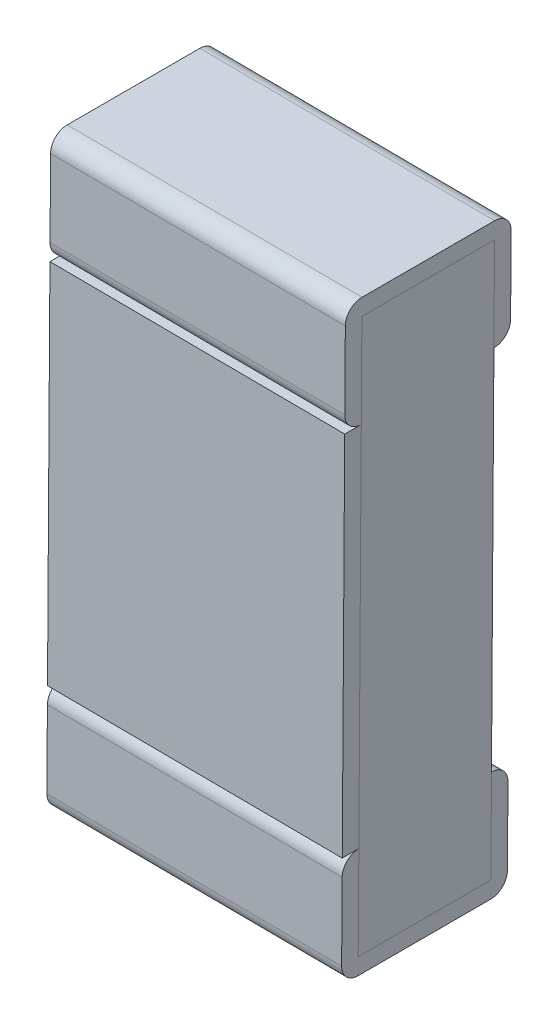
ISO-10303-21;
HEADER;
FILE_DESCRIPTION(('STEP AP214'),'2;1');
FILE_NAME('part.step','',(''),(''),'','','');
FILE_SCHEMA(('AUTOMOTIVE_DESIGN { 1 0 10303 214 1 1 1 1 }'));
ENDSEC;
DATA;
#1=APPLICATION_CONTEXT('core data for automotive mechanical design processes');
#2=APPLICATION_PROTOCOL_DEFINITION('international standard','automotive_design',2000,#1);
#3=PRODUCT_CONTEXT('',#1,'mechanical');
#4=PRODUCT('Part','Part','',(#3));
#5=PRODUCT_RELATED_PRODUCT_CATEGORY('part','',(#4));
#6=PRODUCT_DEFINITION_FORMATION('','',#4);
#7=PRODUCT_DEFINITION_CONTEXT('part definition',#1,'design');
#8=PRODUCT_DEFINITION('design','',#6,#7);
#9=PRODUCT_DEFINITION_SHAPE('','',#8);
#10=(LENGTH_UNIT() NAMED_UNIT(*) SI_UNIT(.MILLI.,.METRE.));
#11=(NAMED_UNIT(*) PLANE_ANGLE_UNIT() SI_UNIT($,.RADIAN.));
#12=(NAMED_UNIT(*) SI_UNIT($,.STERADIAN.) SOLID_ANGLE_UNIT());
#13=UNCERTAINTY_MEASURE_WITH_UNIT(LENGTH_MEASURE(1.E-05),#10,'distance_accuracy_value','');
#14=(GEOMETRIC_REPRESENTATION_CONTEXT(3) GLOBAL_UNCERTAINTY_ASSIGNED_CONTEXT((#13)) GLOBAL_UNIT_ASSIGNED_CONTEXT((#10,
#11,#12)) REPRESENTATION_CONTEXT('',''));
#15=CARTESIAN_POINT('',(0.,0.,0.));
#16=DIRECTION('',(0.,0.,1.));
#17=DIRECTION('',(1.,0.,0.));
#18=AXIS2_PLACEMENT_3D('',#15,#16,#17);
#19=CARTESIAN_POINT('',(189.293084408951,106.579494222817,142.661582908599));
#20=DIRECTION('',(0.,0.,1.));
#21=DIRECTION('',(1.,0.,0.));
#22=AXIS2_PLACEMENT_3D('',#19,#20,#21);
#23=PLANE('',#22);
#24=DIRECTION('',(0.999978016708569,-0.00663069374923689,0.));
#25=VECTOR('',#24,1.);
#26=CARTESIAN_POINT('',(189.293084408951,106.579494222817,142.661582908599));
#27=LINE('',#26,#25);
#28=CARTESIAN_POINT('',(189.293084408951,106.579494222817,142.661582908599));
#29=VERTEX_POINT('',#28);
#30=CARTESIAN_POINT('',(190.093066822317,106.574189667818,142.661582908599));
#31=VERTEX_POINT('',#30);
#32=EDGE_CURVE('E67',#29,#31,#27,.T.);
#33=ORIENTED_EDGE('',*,*,#32,.F.);
#34=DIRECTION('',(-0.00663069374923689,-0.999978016708569,0.));
#35=VECTOR('',#34,1.);
#36=CARTESIAN_POINT('',(189.293084408951,106.579494222817,142.661582908599));
#37=LINE('',#36,#35);
#38=CARTESIAN_POINT('',(189.286453715202,105.579516206109,142.661582908599));
#39=VERTEX_POINT('',#38);
#40=EDGE_CURVE('E11',#29,#39,#37,.T.);
#41=ORIENTED_EDGE('',*,*,#40,.T.);
#42=DIRECTION('',(0.999978016708569,-0.00663069374923689,0.));
#43=VECTOR('',#42,1.);
#44=CARTESIAN_POINT('',(189.286453715202,105.579516206109,142.661582908599));
#45=LINE('',#44,#43);
#46=CARTESIAN_POINT('',(190.086436128569,105.574211651109,142.661582908599));
#47=VERTEX_POINT('',#46);
#48=EDGE_CURVE('E55',#39,#47,#45,.T.);
#49=ORIENTED_EDGE('',*,*,#48,.T.);
#50=DIRECTION('',(-0.00663069374923689,-0.999978016708569,0.));
#51=VECTOR('',#50,1.);
#52=CARTESIAN_POINT('',(190.093066822317,106.574189667818,142.661582908599));
#53=LINE('',#52,#51);
#54=EDGE_CURVE('E268',#31,#47,#53,.T.);
#55=ORIENTED_EDGE('',*,*,#54,.F.);
#56=EDGE_LOOP('',(#33,#41,#49,#55));
#57=FACE_BOUND('',#56,.T.);
#58=ADVANCED_FACE('F44',(#57),#23,.T.);
#59=CARTESIAN_POINT('',(189.286453715202,105.579516206109,142.616582908599));
#60=DIRECTION('',(-0.00663069374923689,-0.99997801670857,0.));
#61=DIRECTION('',(-0.99997801670857,0.00663069374923689,0.));
#62=AXIS2_PLACEMENT_3D('',#59,#60,#61);
#63=PLANE('',#62);
#64=DIRECTION('',(0.,0.,1.));
#65=VECTOR('',#64,1.);
#66=CARTESIAN_POINT('',(189.286453715202,105.579516206109,142.616582908599));
#67=LINE('',#66,#65);
#68=CARTESIAN_POINT('',(189.286453715202,105.579516206109,142.616582908599));
#69=VERTEX_POINT('',#68);
#70=EDGE_CURVE('E288',#69,#39,#67,.T.);
#71=ORIENTED_EDGE('',*,*,#70,.F.);
#72=DIRECTION('',(0.999978016708569,-0.00663069374923689,0.));
#73=VECTOR('',#72,1.);
#74=CARTESIAN_POINT('',(189.286453715202,105.579516206109,142.616582908599));
#75=LINE('',#74,#73);
#76=CARTESIAN_POINT('',(190.086436128569,105.574211651109,142.616582908599));
#77=VERTEX_POINT('',#76);
#78=EDGE_CURVE('E189',#69,#77,#75,.T.);
#79=ORIENTED_EDGE('',*,*,#78,.T.);
#80=DIRECTION('',(0.,0.,1.));
#81=VECTOR('',#80,1.);
#82=CARTESIAN_POINT('',(190.086436128569,105.574211651109,142.616582908599));
#83=LINE('',#82,#81);
#84=EDGE_CURVE('E193',#77,#47,#83,.T.);
#85=ORIENTED_EDGE('',*,*,#84,.T.);
#86=ORIENTED_EDGE('',*,*,#48,.F.);
#87=EDGE_LOOP('',(#71,#79,#85,#86));
#88=FACE_BOUND('',#87,.T.);
#89=ADVANCED_FACE('F552',(#88),#63,.T.);
#90=CARTESIAN_POINT('',(189.286155333983,105.534517195357,142.616582908599));
#91=DIRECTION('',(0.999978016708571,-0.00663069374900344,0.));
#92=DIRECTION('',(0.00663069374900344,0.999978016708571,0.));
#93=AXIS2_PLACEMENT_3D('',#90,#91,#92);
#94=CYLINDRICAL_SURFACE('',#93,0.0450000000000037);
#95=CARTESIAN_POINT('',(189.286155333983,105.534517195357,142.616582908599));
#96=DIRECTION('',(0.99997801670857,-0.00663069374923689,0.));
#97=DIRECTION('',(0.,0.,1.));
#98=AXIS2_PLACEMENT_3D('',#95,#96,#97);
#99=CIRCLE('',#98,0.0449999999999895);
#100=CARTESIAN_POINT('',(189.286155333983,105.534517195357,142.661582908599));
#101=VERTEX_POINT('',#100);
#102=EDGE_CURVE('E341',#69,#101,#99,.T.);
#103=ORIENTED_EDGE('',*,*,#102,.T.);
#104=DIRECTION('',(0.999978016708569,-0.00663069374923689,0.));
#105=VECTOR('',#104,1.);
#106=CARTESIAN_POINT('',(189.286155333983,105.534517195357,142.661582908599));
#107=LINE('',#106,#105);
#108=CARTESIAN_POINT('',(190.08613774735,105.529212640357,142.661582908599));
#109=VERTEX_POINT('',#108);
#110=EDGE_CURVE('E182',#101,#109,#107,.T.);
#111=ORIENTED_EDGE('',*,*,#110,.T.);
#112=CARTESIAN_POINT('',(190.08613774735,105.529212640357,142.616582908599));
#113=DIRECTION('',(0.99997801670857,-0.00663069374923689,0.));
#114=DIRECTION('',(0.,0.,1.));
#115=AXIS2_PLACEMENT_3D('',#112,#113,#114);
#116=CIRCLE('',#115,0.0449999999999895);
#117=EDGE_CURVE('E374',#77,#109,#116,.T.);
#118=ORIENTED_EDGE('',*,*,#117,.F.);
#119=ORIENTED_EDGE('',*,*,#78,.F.);
#120=EDGE_LOOP('',(#103,#111,#118,#119));
#121=FACE_BOUND('',#120,.T.);
#122=ADVANCED_FACE('F46',(#121),#94,.T.);
#123=CARTESIAN_POINT('',(189.286453715202,105.579516206109,142.661582908599));
#124=DIRECTION('',(0.,0.,1.));
#125=DIRECTION('',(1.,0.,0.));
#126=AXIS2_PLACEMENT_3D('',#123,#124,#125);
#127=PLANE('',#126);
#128=DIRECTION('',(-0.00663069374923689,-0.999978016708569,0.));
#129=VECTOR('',#128,1.);
#130=CARTESIAN_POINT('',(190.086436128569,105.574211651109,142.661582908599));
#131=LINE('',#130,#129);
#132=CARTESIAN_POINT('',(190.084745301663,105.319217256848,142.661582908599));
#133=VERTEX_POINT('',#132);
#134=EDGE_CURVE('E224',#109,#133,#131,.T.);
#135=ORIENTED_EDGE('',*,*,#134,.F.);
#136=ORIENTED_EDGE('',*,*,#110,.F.);
#137=DIRECTION('',(-0.00663069374923689,-0.999978016708569,0.));
#138=VECTOR('',#137,1.);
#139=CARTESIAN_POINT('',(189.286453715202,105.579516206109,142.661582908599));
#140=LINE('',#139,#138);
#141=CARTESIAN_POINT('',(189.284762888296,105.324521811848,142.661582908599));
#142=VERTEX_POINT('',#141);
#143=EDGE_CURVE('E350',#101,#142,#140,.T.);
#144=ORIENTED_EDGE('',*,*,#143,.T.);
#145=DIRECTION('',(0.999978016708569,-0.00663069374923689,0.));
#146=VECTOR('',#145,1.);
#147=CARTESIAN_POINT('',(189.284762888296,105.324521811848,142.661582908599));
#148=LINE('',#147,#146);
#149=EDGE_CURVE('E326',#142,#133,#148,.T.);
#150=ORIENTED_EDGE('',*,*,#149,.T.);
#151=EDGE_LOOP('',(#135,#136,#144,#150));
#152=FACE_BOUND('',#151,.T.);
#153=ADVANCED_FACE('F400',(#152),#127,.T.);
#154=CARTESIAN_POINT('',(189.284762888296,105.324521811848,142.616582908599));
#155=DIRECTION('',(0.999978016708571,-0.00663069374900344,0.));
#156=DIRECTION('',(-0.00663069374900344,-0.999978016708571,0.));
#157=AXIS2_PLACEMENT_3D('',#154,#155,#156);
#158=CYLINDRICAL_SURFACE('',#157,0.0450000000000037);
#159=DIRECTION('',(0.999978016708569,-0.00663069374923689,0.));
#160=VECTOR('',#159,1.);
#161=CARTESIAN_POINT('',(189.284464507077,105.279522801096,142.616582908599));
#162=LINE('',#161,#160);
#163=CARTESIAN_POINT('',(189.284464507077,105.279522801096,142.616582908599));
#164=VERTEX_POINT('',#163);
#165=CARTESIAN_POINT('',(190.084446920444,105.274218246097,142.616582908599));
#166=VERTEX_POINT('',#165);
#167=EDGE_CURVE('E263',#164,#166,#162,.T.);
#168=ORIENTED_EDGE('',*,*,#167,.T.);
#169=CARTESIAN_POINT('',(190.084745301663,105.319217256848,142.616582908599));
#170=DIRECTION('',(-0.99997801670857,0.00663069374923689,0.));
#171=DIRECTION('',(0.,0.,1.));
#172=AXIS2_PLACEMENT_3D('',#169,#170,#171);
#173=CIRCLE('',#172,0.0449999999999895);
#174=EDGE_CURVE('E254',#166,#133,#173,.T.);
#175=ORIENTED_EDGE('',*,*,#174,.T.);
#176=ORIENTED_EDGE('',*,*,#149,.F.);
#177=CARTESIAN_POINT('',(189.284762888296,105.324521811848,142.616582908599));
#178=DIRECTION('',(-0.99997801670857,0.00663069374923689,0.));
#179=DIRECTION('',(0.,0.,1.));
#180=AXIS2_PLACEMENT_3D('',#177,#178,#179);
#181=CIRCLE('',#180,0.0449999999999895);
#182=EDGE_CURVE('E199',#164,#142,#181,.T.);
#183=ORIENTED_EDGE('',*,*,#182,.F.);
#184=EDGE_LOOP('',(#168,#175,#176,#183));
#185=FACE_BOUND('',#184,.T.);
#186=ADVANCED_FACE('F409',(#185),#158,.T.);
#187=CARTESIAN_POINT('',(189.284464507077,105.279522801096,142.211582908599));
#188=DIRECTION('',(-0.00663069374923689,-0.99997801670857,0.));
#189=DIRECTION('',(-0.99997801670857,0.00663069374923689,0.));
#190=AXIS2_PLACEMENT_3D('',#187,#188,#189);
#191=PLANE('',#190);
#192=DIRECTION('',(0.,0.,1.));
#193=VECTOR('',#192,1.);
#194=CARTESIAN_POINT('',(189.284464507077,105.279522801096,142.211582908599));
#195=LINE('',#194,#193);
#196=CARTESIAN_POINT('',(189.284464507077,105.279522801096,142.256582908599));
#197=VERTEX_POINT('',#196);
#198=EDGE_CURVE('E194',#197,#164,#195,.T.);
#199=ORIENTED_EDGE('',*,*,#198,.F.);
#200=DIRECTION('',(0.999978016708569,-0.00663069374923689,0.));
#201=VECTOR('',#200,1.);
#202=CARTESIAN_POINT('',(189.284464507077,105.279522801096,142.256582908599));
#203=LINE('',#202,#201);
#204=CARTESIAN_POINT('',(190.084446920444,105.274218246097,142.256582908599));
#205=VERTEX_POINT('',#204);
#206=EDGE_CURVE('E187',#197,#205,#203,.T.);
#207=ORIENTED_EDGE('',*,*,#206,.T.);
#208=DIRECTION('',(0.,0.,1.));
#209=VECTOR('',#208,1.);
#210=CARTESIAN_POINT('',(190.084446920444,105.274218246097,142.211582908599));
#211=LINE('',#210,#209);
#212=EDGE_CURVE('E184',#205,#166,#211,.T.);
#213=ORIENTED_EDGE('',*,*,#212,.T.);
#214=ORIENTED_EDGE('',*,*,#167,.F.);
#215=EDGE_LOOP('',(#199,#207,#213,#214));
#216=FACE_BOUND('',#215,.T.);
#217=ADVANCED_FACE('F654',(#216),#191,.T.);
#218=CARTESIAN_POINT('',(189.284762888296,105.324521811848,142.256582908599));
#219=DIRECTION('',(0.999978016708571,-0.00663069374900344,0.));
#220=DIRECTION('',(-0.00663069374900344,-0.999978016708571,0.));
#221=AXIS2_PLACEMENT_3D('',#218,#219,#220);
#222=CYLINDRICAL_SURFACE('',#221,0.0450000000000037);
#223=CARTESIAN_POINT('',(189.284762888296,105.324521811848,142.256582908599));
#224=DIRECTION('',(0.99997801670857,-0.00663069374923689,0.));
#225=DIRECTION('',(0.,0.,1.));
#226=AXIS2_PLACEMENT_3D('',#223,#224,#225);
#227=CIRCLE('',#226,0.0449999999999895);
#228=CARTESIAN_POINT('',(189.284762888296,105.324521811848,142.211582908599));
#229=VERTEX_POINT('',#228);
#230=EDGE_CURVE('E188',#197,#229,#227,.T.);
#231=ORIENTED_EDGE('',*,*,#230,.T.);
#232=DIRECTION('',(0.999978016708569,-0.00663069374923689,0.));
#233=VECTOR('',#232,1.);
#234=CARTESIAN_POINT('',(189.284762888296,105.324521811848,142.211582908599));
#235=LINE('',#234,#233);
#236=CARTESIAN_POINT('',(190.084745301663,105.319217256848,142.211582908599));
#237=VERTEX_POINT('',#236);
#238=EDGE_CURVE('E303',#229,#237,#235,.T.);
#239=ORIENTED_EDGE('',*,*,#238,.T.);
#240=CARTESIAN_POINT('',(190.084745301663,105.319217256848,142.256582908599));
#241=DIRECTION('',(0.99997801670857,-0.00663069374923689,0.));
#242=DIRECTION('',(0.,0.,1.));
#243=AXIS2_PLACEMENT_3D('',#240,#241,#242);
#244=CIRCLE('',#243,0.0449999999999895);
#245=EDGE_CURVE('E220',#205,#237,#244,.T.);
#246=ORIENTED_EDGE('',*,*,#245,.F.);
#247=ORIENTED_EDGE('',*,*,#206,.F.);
#248=EDGE_LOOP('',(#231,#239,#246,#247));
#249=FACE_BOUND('',#248,.T.);
#250=ADVANCED_FACE('F650',(#249),#222,.T.);
#251=CARTESIAN_POINT('',(189.286453715202,105.579516206109,142.211582908599));
#252=DIRECTION('',(0.,0.,1.));
#253=DIRECTION('',(1.,0.,0.));
#254=AXIS2_PLACEMENT_3D('',#251,#252,#253);
#255=PLANE('',#254);
#256=ORIENTED_EDGE('',*,*,#238,.F.);
#257=DIRECTION('',(-0.00663069374923689,-0.999978016708569,0.));
#258=VECTOR('',#257,1.);
#259=CARTESIAN_POINT('',(189.286453715202,105.579516206109,142.211582908599));
#260=LINE('',#259,#258);
#261=CARTESIAN_POINT('',(189.286155333983,105.534517195357,142.211582908599));
#262=VERTEX_POINT('',#261);
#263=EDGE_CURVE('E205',#262,#229,#260,.T.);
#264=ORIENTED_EDGE('',*,*,#263,.F.);
#265=DIRECTION('',(0.999978016708569,-0.00663069374923689,0.));
#266=VECTOR('',#265,1.);
#267=CARTESIAN_POINT('',(189.286155333983,105.534517195357,142.211582908599));
#268=LINE('',#267,#266);
#269=CARTESIAN_POINT('',(190.08613774735,105.529212640357,142.211582908599));
#270=VERTEX_POINT('',#269);
#271=EDGE_CURVE('E307',#262,#270,#268,.T.);
#272=ORIENTED_EDGE('',*,*,#271,.T.);
#273=DIRECTION('',(-0.00663069374923689,-0.999978016708569,0.));
#274=VECTOR('',#273,1.);
#275=CARTESIAN_POINT('',(190.086436128569,105.574211651109,142.211582908599));
#276=LINE('',#275,#274);
#277=EDGE_CURVE('E308',#270,#237,#276,.T.);
#278=ORIENTED_EDGE('',*,*,#277,.T.);
#279=EDGE_LOOP('',(#256,#264,#272,#278));
#280=FACE_BOUND('',#279,.T.);
#281=ADVANCED_FACE('F632',(#280),#255,.F.);
#282=CARTESIAN_POINT('',(189.286155333983,105.534517195357,142.256582908599));
#283=DIRECTION('',(0.999978016708571,-0.00663069374900344,0.));
#284=DIRECTION('',(0.00663069374900344,0.999978016708571,0.));
#285=AXIS2_PLACEMENT_3D('',#282,#283,#284);
#286=CYLINDRICAL_SURFACE('',#285,0.0450000000000037);
#287=DIRECTION('',(0.999978016708569,-0.00663069374923689,0.));
#288=VECTOR('',#287,1.);
#289=CARTESIAN_POINT('',(189.286453715202,105.579516206109,142.256582908599));
#290=LINE('',#289,#288);
#291=CARTESIAN_POINT('',(189.286453715202,105.579516206109,142.256582908599));
#292=VERTEX_POINT('',#291);
#293=CARTESIAN_POINT('',(190.086436128569,105.574211651109,142.256582908599));
#294=VERTEX_POINT('',#293);
#295=EDGE_CURVE('E237',#292,#294,#290,.T.);
#296=ORIENTED_EDGE('',*,*,#295,.T.);
#297=CARTESIAN_POINT('',(190.08613774735,105.529212640357,142.256582908599));
#298=DIRECTION('',(-0.99997801670857,0.00663069374923689,0.));
#299=DIRECTION('',(0.,0.,1.));
#300=AXIS2_PLACEMENT_3D('',#297,#298,#299);
#301=CIRCLE('',#300,0.0449999999999895);
#302=EDGE_CURVE('E233',#294,#270,#301,.T.);
#303=ORIENTED_EDGE('',*,*,#302,.T.);
#304=ORIENTED_EDGE('',*,*,#271,.F.);
#305=CARTESIAN_POINT('',(189.286155333983,105.534517195357,142.256582908599));
#306=DIRECTION('',(-0.99997801670857,0.00663069374923689,0.));
#307=DIRECTION('',(0.,0.,1.));
#308=AXIS2_PLACEMENT_3D('',#305,#306,#307);
#309=CIRCLE('',#308,0.0449999999999895);
#310=EDGE_CURVE('E200',#292,#262,#309,.T.);
#311=ORIENTED_EDGE('',*,*,#310,.F.);
#312=EDGE_LOOP('',(#296,#303,#304,#311));
#313=FACE_BOUND('',#312,.T.);
#314=ADVANCED_FACE('F513',(#313),#286,.T.);
#315=CARTESIAN_POINT('',(190.093066822317,106.574189667818,142.616582908599));
#316=DIRECTION('',(0.99997801670857,-0.00663069374923689,0.));
#317=DIRECTION('',(0.,0.,-1.));
#318=AXIS2_PLACEMENT_3D('',#315,#316,#317);
#319=PLANE('',#318);
#320=DIRECTION('',(-0.00663069374923689,-0.999978016708569,0.));
#321=VECTOR('',#320,1.);
#322=CARTESIAN_POINT('',(190.093066822317,106.574189667818,142.616582908599));
#323=LINE('',#322,#321);
#324=CARTESIAN_POINT('',(190.093066822317,106.574189667818,142.616582908599));
#325=VERTEX_POINT('',#324);
#326=EDGE_CURVE('E339',#325,#77,#323,.T.);
#327=ORIENTED_EDGE('',*,*,#326,.F.);
#328=DIRECTION('',(0.,0.,1.));
#329=VECTOR('',#328,1.);
#330=CARTESIAN_POINT('',(190.093066822317,106.574189667818,142.616582908599));
#331=LINE('',#330,#329);
#332=EDGE_CURVE('E238',#325,#31,#331,.T.);
#333=ORIENTED_EDGE('',*,*,#332,.T.);
#334=ORIENTED_EDGE('',*,*,#54,.T.);
#335=ORIENTED_EDGE('',*,*,#84,.F.);
#336=EDGE_LOOP('',(#327,#333,#334,#335));
#337=FACE_BOUND('',#336,.T.);
#338=ADVANCED_FACE('F631',(#337),#319,.T.);
#339=CARTESIAN_POINT('',(190.086436128569,105.574211651109,142.211582908599));
#340=DIRECTION('',(0.99997801670857,-0.00663069374923689,0.));
#341=DIRECTION('',(0.,0.,-1.));
#342=AXIS2_PLACEMENT_3D('',#339,#340,#341);
#343=PLANE('',#342);
#344=ORIENTED_EDGE('',*,*,#277,.F.);
#345=ORIENTED_EDGE('',*,*,#302,.F.);
#346=DIRECTION('',(-0.00663069374923689,-0.999978016708569,0.));
#347=VECTOR('',#346,1.);
#348=CARTESIAN_POINT('',(190.094757649223,106.829184062078,142.256582908599));
#349=LINE('',#348,#347);
#350=CARTESIAN_POINT('',(190.084745301663,105.319217256848,142.256582908599));
#351=VERTEX_POINT('',#350);
#352=EDGE_CURVE('E264',#294,#351,#349,.T.);
#353=ORIENTED_EDGE('',*,*,#352,.T.);
#354=DIRECTION('',(0.,0.,1.));
#355=VECTOR('',#354,1.);
#356=CARTESIAN_POINT('',(190.084745301663,105.319217256848,142.256582908599));
#357=LINE('',#356,#355);
#358=CARTESIAN_POINT('',(190.084745301663,105.319217256848,142.616582908599));
#359=VERTEX_POINT('',#358);
#360=EDGE_CURVE('E269',#351,#359,#357,.T.);
#361=ORIENTED_EDGE('',*,*,#360,.T.);
#362=DIRECTION('',(-0.00663069374923689,-0.999978016708569,0.));
#363=VECTOR('',#362,1.);
#364=CARTESIAN_POINT('',(190.094757649223,106.829184062078,142.616582908599));
#365=LINE('',#364,#363);
#366=EDGE_CURVE('E356',#77,#359,#365,.T.);
#367=ORIENTED_EDGE('',*,*,#366,.F.);
#368=ORIENTED_EDGE('',*,*,#117,.T.);
#369=ORIENTED_EDGE('',*,*,#134,.T.);
#370=ORIENTED_EDGE('',*,*,#174,.F.);
#371=ORIENTED_EDGE('',*,*,#212,.F.);
#372=ORIENTED_EDGE('',*,*,#245,.T.);
#373=EDGE_LOOP('',(#344,#345,#353,#361,#367,#368,#369,#370,#371,#372));
#374=FACE_BOUND('',#373,.T.);
#375=ADVANCED_FACE('F412',(#374),#343,.T.);
#376=CARTESIAN_POINT('',(189.293084408951,106.579494222817,142.616582908599));
#377=DIRECTION('',(-0.00663069374923689,-0.99997801670857,0.));
#378=DIRECTION('',(-0.99997801670857,0.00663069374923689,0.));
#379=AXIS2_PLACEMENT_3D('',#376,#377,#378);
#380=PLANE('',#379);
#381=ORIENTED_EDGE('',*,*,#32,.T.);
#382=ORIENTED_EDGE('',*,*,#332,.F.);
#383=DIRECTION('',(0.999978016708569,-0.00663069374923689,0.));
#384=VECTOR('',#383,1.);
#385=CARTESIAN_POINT('',(189.293084408951,106.579494222817,142.616582908599));
#386=LINE('',#385,#384);
#387=CARTESIAN_POINT('',(189.293084408951,106.579494222817,142.616582908599));
#388=VERTEX_POINT('',#387);
#389=EDGE_CURVE('E178',#388,#325,#386,.T.);
#390=ORIENTED_EDGE('',*,*,#389,.F.);
#391=DIRECTION('',(0.,0.,1.));
#392=VECTOR('',#391,1.);
#393=CARTESIAN_POINT('',(189.293084408951,106.579494222817,142.616582908599));
#394=LINE('',#393,#392);
#395=EDGE_CURVE('E278',#388,#29,#394,.T.);
#396=ORIENTED_EDGE('',*,*,#395,.T.);
#397=EDGE_LOOP('',(#381,#382,#390,#396));
#398=FACE_BOUND('',#397,.T.);
#399=ADVANCED_FACE('F592',(#398),#380,.F.);
#400=CARTESIAN_POINT('',(189.293084408951,106.579494222817,142.616582908599));
#401=DIRECTION('',(0.99997801670857,-0.00663069374923689,0.));
#402=DIRECTION('',(0.,0.,-1.));
#403=AXIS2_PLACEMENT_3D('',#400,#401,#402);
#404=PLANE('',#403);
#405=ORIENTED_EDGE('',*,*,#70,.T.);
#406=ORIENTED_EDGE('',*,*,#40,.F.);
#407=ORIENTED_EDGE('',*,*,#395,.F.);
#408=DIRECTION('',(-0.00663069374923689,-0.999978016708569,0.));
#409=VECTOR('',#408,1.);
#410=CARTESIAN_POINT('',(189.293084408951,106.579494222817,142.616582908599));
#411=LINE('',#410,#409);
#412=EDGE_CURVE('E198',#388,#69,#411,.T.);
#413=ORIENTED_EDGE('',*,*,#412,.T.);
#414=EDGE_LOOP('',(#405,#406,#407,#413));
#415=FACE_BOUND('',#414,.T.);
#416=ADVANCED_FACE('F596',(#415),#404,.F.);
#417=CARTESIAN_POINT('',(189.286453715202,105.579516206109,142.211582908599));
#418=DIRECTION('',(0.99997801670857,-0.00663069374923689,0.));
#419=DIRECTION('',(0.,0.,-1.));
#420=AXIS2_PLACEMENT_3D('',#417,#418,#419);
#421=PLANE('',#420);
#422=ORIENTED_EDGE('',*,*,#230,.F.);
#423=ORIENTED_EDGE('',*,*,#198,.T.);
#424=ORIENTED_EDGE('',*,*,#182,.T.);
#425=ORIENTED_EDGE('',*,*,#143,.F.);
#426=ORIENTED_EDGE('',*,*,#102,.F.);
#427=DIRECTION('',(-0.00663069374923689,-0.999978016708569,0.));
#428=VECTOR('',#427,1.);
#429=CARTESIAN_POINT('',(189.294775235857,106.834488617078,142.616582908599));
#430=LINE('',#429,#428);
#431=CARTESIAN_POINT('',(189.284762888296,105.324521811848,142.616582908599));
#432=VERTEX_POINT('',#431);
#433=EDGE_CURVE('E204',#69,#432,#430,.T.);
#434=ORIENTED_EDGE('',*,*,#433,.T.);
#435=DIRECTION('',(0.,0.,1.));
#436=VECTOR('',#435,1.);
#437=CARTESIAN_POINT('',(189.284762888296,105.324521811848,142.256582908599));
#438=LINE('',#437,#436);
#439=CARTESIAN_POINT('',(189.284762888296,105.324521811848,142.256582908599));
#440=VERTEX_POINT('',#439);
#441=EDGE_CURVE('E249',#440,#432,#438,.T.);
#442=ORIENTED_EDGE('',*,*,#441,.F.);
#443=DIRECTION('',(-0.00663069374923689,-0.999978016708569,0.));
#444=VECTOR('',#443,1.);
#445=CARTESIAN_POINT('',(189.294775235857,106.834488617078,142.256582908599));
#446=LINE('',#445,#444);
#447=EDGE_CURVE('E246',#292,#440,#446,.T.);
#448=ORIENTED_EDGE('',*,*,#447,.F.);
#449=ORIENTED_EDGE('',*,*,#310,.T.);
#450=ORIENTED_EDGE('',*,*,#263,.T.);
#451=EDGE_LOOP('',(#422,#423,#424,#425,#426,#434,#442,#448,#449,#450));
#452=FACE_BOUND('',#451,.T.);
#453=ADVANCED_FACE('F503',(#452),#421,.F.);
#454=CARTESIAN_POINT('',(189.294775235857,106.834488617078,142.256582908599));
#455=DIRECTION('',(0.,0.,1.));
#456=DIRECTION('',(1.,0.,0.));
#457=AXIS2_PLACEMENT_3D('',#454,#455,#456);
#458=PLANE('',#457);
#459=DIRECTION('',(-0.00663069374923689,-0.999978016708569,0.));
#460=VECTOR('',#459,1.);
#461=CARTESIAN_POINT('',(190.094757649223,106.829184062078,142.256582908599));
#462=LINE('',#461,#460);
#463=CARTESIAN_POINT('',(190.093066822317,106.574189667818,142.256582908599));
#464=VERTEX_POINT('',#463);
#465=EDGE_CURVE('E273',#464,#294,#462,.T.);
#466=ORIENTED_EDGE('',*,*,#465,.T.);
#467=ORIENTED_EDGE('',*,*,#295,.F.);
#468=DIRECTION('',(-0.00663069374923689,-0.999978016708569,0.));
#469=VECTOR('',#468,1.);
#470=CARTESIAN_POINT('',(189.294775235857,106.834488617078,142.256582908599));
#471=LINE('',#470,#469);
#472=CARTESIAN_POINT('',(189.293084408951,106.579494222817,142.256582908599));
#473=VERTEX_POINT('',#472);
#474=EDGE_CURVE('E167',#473,#292,#471,.T.);
#475=ORIENTED_EDGE('',*,*,#474,.F.);
#476=DIRECTION('',(0.999978016708569,-0.00663069374923689,0.));
#477=VECTOR('',#476,1.);
#478=CARTESIAN_POINT('',(189.293084408951,106.579494222817,142.256582908599));
#479=LINE('',#478,#477);
#480=EDGE_CURVE('E270',#473,#464,#479,.T.);
#481=ORIENTED_EDGE('',*,*,#480,.T.);
#482=EDGE_LOOP('',(#466,#467,#475,#481));
#483=FACE_BOUND('',#482,.T.);
#484=ADVANCED_FACE('F515',(#483),#458,.F.);
#485=CARTESIAN_POINT('',(190.094757649223,106.829184062078,142.256582908599));
#486=DIRECTION('',(0.99997801670857,-0.00663069374923689,0.));
#487=DIRECTION('',(0.,0.,-1.));
#488=AXIS2_PLACEMENT_3D('',#485,#486,#487);
#489=PLANE('',#488);
#490=DIRECTION('',(-0.00663069374923689,-0.999978016708569,0.));
#491=VECTOR('',#490,1.);
#492=CARTESIAN_POINT('',(190.094757649223,106.829184062078,142.256582908599));
#493=LINE('',#492,#491);
#494=CARTESIAN_POINT('',(190.094757649223,106.829184062078,142.256582908599));
#495=VERTEX_POINT('',#494);
#496=EDGE_CURVE('E211',#495,#464,#493,.T.);
#497=ORIENTED_EDGE('',*,*,#496,.F.);
#498=DIRECTION('',(0.,0.,1.));
#499=VECTOR('',#498,1.);
#500=CARTESIAN_POINT('',(190.094757649223,106.829184062078,142.256582908599));
#501=LINE('',#500,#499);
#502=CARTESIAN_POINT('',(190.094757649223,106.829184062078,142.616582908599));
#503=VERTEX_POINT('',#502);
#504=EDGE_CURVE('E274',#495,#503,#501,.T.);
#505=ORIENTED_EDGE('',*,*,#504,.T.);
#506=DIRECTION('',(-0.00663069374923689,-0.999978016708569,0.));
#507=VECTOR('',#506,1.);
#508=CARTESIAN_POINT('',(190.094757649223,106.829184062078,142.616582908599));
#509=LINE('',#508,#507);
#510=EDGE_CURVE('E336',#503,#325,#509,.T.);
#511=ORIENTED_EDGE('',*,*,#510,.T.);
#512=ORIENTED_EDGE('',*,*,#326,.T.);
#513=ORIENTED_EDGE('',*,*,#366,.T.);
#514=ORIENTED_EDGE('',*,*,#360,.F.);
#515=ORIENTED_EDGE('',*,*,#352,.F.);
#516=ORIENTED_EDGE('',*,*,#465,.F.);
#517=EDGE_LOOP('',(#497,#505,#511,#512,#513,#514,#515,#516));
#518=FACE_BOUND('',#517,.T.);
#519=ADVANCED_FACE('F520',(#518),#489,.T.);
#520=CARTESIAN_POINT('',(189.29338279017,106.624493233569,142.616582908599));
#521=DIRECTION('',(0.999978016708571,-0.00663069374900344,0.));
#522=DIRECTION('',(-0.00663069374900344,-0.999978016708571,0.));
#523=AXIS2_PLACEMENT_3D('',#520,#521,#522);
#524=CYLINDRICAL_SURFACE('',#523,0.0450000000000037);
#525=ORIENTED_EDGE('',*,*,#389,.T.);
#526=CARTESIAN_POINT('',(190.093365203537,106.61918867857,142.616582908599));
#527=DIRECTION('',(-0.99997801670857,0.00663069374923689,0.));
#528=DIRECTION('',(0.,0.,1.));
#529=AXIS2_PLACEMENT_3D('',#526,#527,#528);
#530=CIRCLE('',#529,0.0449999999999895);
#531=CARTESIAN_POINT('',(190.093365203537,106.61918867857,142.661582908599));
#532=VERTEX_POINT('',#531);
#533=EDGE_CURVE('E162',#325,#532,#530,.T.);
#534=ORIENTED_EDGE('',*,*,#533,.T.);
#535=DIRECTION('',(0.999978016708569,-0.00663069374923689,0.));
#536=VECTOR('',#535,1.);
#537=CARTESIAN_POINT('',(189.29338279017,106.624493233569,142.661582908599));
#538=LINE('',#537,#536);
#539=CARTESIAN_POINT('',(189.29338279017,106.624493233569,142.661582908599));
#540=VERTEX_POINT('',#539);
#541=EDGE_CURVE('E159',#540,#532,#538,.T.);
#542=ORIENTED_EDGE('',*,*,#541,.F.);
#543=CARTESIAN_POINT('',(189.29338279017,106.624493233569,142.616582908599));
#544=DIRECTION('',(-0.99997801670857,0.00663069374923689,0.));
#545=DIRECTION('',(0.,0.,1.));
#546=AXIS2_PLACEMENT_3D('',#543,#544,#545);
#547=CIRCLE('',#546,0.0449999999999895);
#548=EDGE_CURVE('E141',#388,#540,#547,.T.);
#549=ORIENTED_EDGE('',*,*,#548,.F.);
#550=EDGE_LOOP('',(#525,#534,#542,#549));
#551=FACE_BOUND('',#550,.T.);
#552=ADVANCED_FACE('F160',(#551),#524,.T.);
#553=CARTESIAN_POINT('',(189.295073617076,106.87948762783,142.661582908599));
#554=DIRECTION('',(0.,0.,1.));
#555=DIRECTION('',(1.,0.,0.));
#556=AXIS2_PLACEMENT_3D('',#553,#554,#555);
#557=PLANE('',#556);
#558=DIRECTION('',(-0.00663069374923689,-0.999978016708569,0.));
#559=VECTOR('',#558,1.);
#560=CARTESIAN_POINT('',(190.095056030443,106.87418307283,142.661582908599));
#561=LINE('',#560,#559);
#562=CARTESIAN_POINT('',(190.094757649223,106.829184062078,142.661582908599));
#563=VERTEX_POINT('',#562);
#564=EDGE_CURVE('E215',#563,#532,#561,.T.);
#565=ORIENTED_EDGE('',*,*,#564,.F.);
#566=DIRECTION('',(0.999978016708569,-0.00663069374923689,0.));
#567=VECTOR('',#566,1.);
#568=CARTESIAN_POINT('',(189.294775235857,106.834488617078,142.661582908599));
#569=LINE('',#568,#567);
#570=CARTESIAN_POINT('',(189.294775235857,106.834488617078,142.661582908599));
#571=VERTEX_POINT('',#570);
#572=EDGE_CURVE('E171',#571,#563,#569,.T.);
#573=ORIENTED_EDGE('',*,*,#572,.F.);
#574=DIRECTION('',(-0.00663069374923689,-0.999978016708569,0.));
#575=VECTOR('',#574,1.);
#576=CARTESIAN_POINT('',(189.295073617076,106.87948762783,142.661582908599));
#577=LINE('',#576,#575);
#578=EDGE_CURVE('E147',#571,#540,#577,.T.);
#579=ORIENTED_EDGE('',*,*,#578,.T.);
#580=ORIENTED_EDGE('',*,*,#541,.T.);
#581=EDGE_LOOP('',(#565,#573,#579,#580));
#582=FACE_BOUND('',#581,.T.);
#583=ADVANCED_FACE('F170',(#582),#557,.T.);
#584=CARTESIAN_POINT('',(189.294775235857,106.834488617078,142.256582908599));
#585=DIRECTION('',(0.99997801670857,-0.00663069374923689,0.));
#586=DIRECTION('',(0.,0.,-1.));
#587=AXIS2_PLACEMENT_3D('',#584,#585,#586);
#588=PLANE('',#587);
#589=ORIENTED_EDGE('',*,*,#474,.T.);
#590=ORIENTED_EDGE('',*,*,#447,.T.);
#591=ORIENTED_EDGE('',*,*,#441,.T.);
#592=ORIENTED_EDGE('',*,*,#433,.F.);
#593=ORIENTED_EDGE('',*,*,#412,.F.);
#594=DIRECTION('',(-0.00663069374923689,-0.999978016708569,0.));
#595=VECTOR('',#594,1.);
#596=CARTESIAN_POINT('',(189.294775235857,106.834488617078,142.616582908599));
#597=LINE('',#596,#595);
#598=CARTESIAN_POINT('',(189.294775235857,106.834488617078,142.616582908599));
#599=VERTEX_POINT('',#598);
#600=EDGE_CURVE('E151',#599,#388,#597,.T.);
#601=ORIENTED_EDGE('',*,*,#600,.F.);
#602=DIRECTION('',(0.,0.,1.));
#603=VECTOR('',#602,1.);
#604=CARTESIAN_POINT('',(189.294775235857,106.834488617078,142.256582908599));
#605=LINE('',#604,#603);
#606=CARTESIAN_POINT('',(189.294775235857,106.834488617078,142.256582908599));
#607=VERTEX_POINT('',#606);
#608=EDGE_CURVE('E219',#607,#599,#605,.T.);
#609=ORIENTED_EDGE('',*,*,#608,.F.);
#610=DIRECTION('',(-0.00663069374923689,-0.999978016708569,0.));
#611=VECTOR('',#610,1.);
#612=CARTESIAN_POINT('',(189.294775235857,106.834488617078,142.256582908599));
#613=LINE('',#612,#611);
#614=EDGE_CURVE('E255',#607,#473,#613,.T.);
#615=ORIENTED_EDGE('',*,*,#614,.T.);
#616=EDGE_LOOP('',(#589,#590,#591,#592,#593,#601,#609,#615));
#617=FACE_BOUND('',#616,.T.);
#618=ADVANCED_FACE('F507',(#617),#588,.F.);
#619=CARTESIAN_POINT('',(189.29338279017,106.624493233569,142.256582908599));
#620=DIRECTION('',(0.999978016708571,-0.00663069374900344,0.));
#621=DIRECTION('',(-0.00663069374900344,-0.999978016708571,0.));
#622=AXIS2_PLACEMENT_3D('',#619,#620,#621);
#623=CYLINDRICAL_SURFACE('',#622,0.0450000000000037);
#624=CARTESIAN_POINT('',(189.29338279017,106.624493233569,142.256582908599));
#625=DIRECTION('',(0.99997801670857,-0.00663069374923689,0.));
#626=DIRECTION('',(0.,0.,1.));
#627=AXIS2_PLACEMENT_3D('',#624,#625,#626);
#628=CIRCLE('',#627,0.0449999999999895);
#629=CARTESIAN_POINT('',(189.29338279017,106.624493233569,142.211582908599));
#630=VERTEX_POINT('',#629);
#631=EDGE_CURVE('E259',#473,#630,#628,.T.);
#632=ORIENTED_EDGE('',*,*,#631,.T.);
#633=DIRECTION('',(0.999978016708569,-0.00663069374923689,0.));
#634=VECTOR('',#633,1.);
#635=CARTESIAN_POINT('',(189.29338279017,106.624493233569,142.211582908599));
#636=LINE('',#635,#634);
#637=CARTESIAN_POINT('',(190.093365203537,106.61918867857,142.211582908599));
#638=VERTEX_POINT('',#637);
#639=EDGE_CURVE('E298',#630,#638,#636,.T.);
#640=ORIENTED_EDGE('',*,*,#639,.T.);
#641=CARTESIAN_POINT('',(190.093365203537,106.61918867857,142.256582908599));
#642=DIRECTION('',(0.99997801670857,-0.00663069374923689,0.));
#643=DIRECTION('',(0.,0.,1.));
#644=AXIS2_PLACEMENT_3D('',#641,#642,#643);
#645=CIRCLE('',#644,0.0449999999999895);
#646=EDGE_CURVE('E216',#464,#638,#645,.T.);
#647=ORIENTED_EDGE('',*,*,#646,.F.);
#648=ORIENTED_EDGE('',*,*,#480,.F.);
#649=EDGE_LOOP('',(#632,#640,#647,#648));
#650=FACE_BOUND('',#649,.T.);
#651=ADVANCED_FACE('F525',(#650),#623,.T.);
#652=CARTESIAN_POINT('',(189.295073617076,106.87948762783,142.211582908599));
#653=DIRECTION('',(0.,0.,1.));
#654=DIRECTION('',(1.,0.,0.));
#655=AXIS2_PLACEMENT_3D('',#652,#653,#654);
#656=PLANE('',#655);
#657=ORIENTED_EDGE('',*,*,#639,.F.);
#658=DIRECTION('',(-0.00663069374923689,-0.999978016708569,0.));
#659=VECTOR('',#658,1.);
#660=CARTESIAN_POINT('',(189.295073617076,106.87948762783,142.211582908599));
#661=LINE('',#660,#659);
#662=CARTESIAN_POINT('',(189.294775235857,106.834488617078,142.211582908599));
#663=VERTEX_POINT('',#662);
#664=EDGE_CURVE('E206',#663,#630,#661,.T.);
#665=ORIENTED_EDGE('',*,*,#664,.F.);
#666=DIRECTION('',(0.999978016708569,-0.00663069374923689,0.));
#667=VECTOR('',#666,1.);
#668=CARTESIAN_POINT('',(189.294775235857,106.834488617078,142.211582908599));
#669=LINE('',#668,#667);
#670=CARTESIAN_POINT('',(190.094757649223,106.829184062078,142.211582908599));
#671=VERTEX_POINT('',#670);
#672=EDGE_CURVE('E48',#663,#671,#669,.T.);
#673=ORIENTED_EDGE('',*,*,#672,.T.);
#674=DIRECTION('',(-0.00663069374923689,-0.999978016708569,0.));
#675=VECTOR('',#674,1.);
#676=CARTESIAN_POINT('',(190.095056030443,106.87418307283,142.211582908599));
#677=LINE('',#676,#675);
#678=EDGE_CURVE('E299',#671,#638,#677,.T.);
#679=ORIENTED_EDGE('',*,*,#678,.T.);
#680=EDGE_LOOP('',(#657,#665,#673,#679));
#681=FACE_BOUND('',#680,.T.);
#682=ADVANCED_FACE('F608',(#681),#656,.F.);
#683=CARTESIAN_POINT('',(190.095056030443,106.87418307283,142.211582908599));
#684=DIRECTION('',(0.99997801670857,-0.00663069374923689,0.));
#685=DIRECTION('',(0.,0.,-1.));
#686=AXIS2_PLACEMENT_3D('',#683,#684,#685);
#687=PLANE('',#686);
#688=ORIENTED_EDGE('',*,*,#678,.F.);
#689=CARTESIAN_POINT('',(190.094757649223,106.829184062078,142.256582908599));
#690=DIRECTION('',(-0.99997801670857,0.00663069374923689,0.));
#691=DIRECTION('',(0.,0.,1.));
#692=AXIS2_PLACEMENT_3D('',#689,#690,#691);
#693=CIRCLE('',#692,0.0449999999999895);
#694=CARTESIAN_POINT('',(190.095056030443,106.87418307283,142.256582908599));
#695=VERTEX_POINT('',#694);
#696=EDGE_CURVE('E241',#695,#671,#693,.T.);
#697=ORIENTED_EDGE('',*,*,#696,.F.);
#698=DIRECTION('',(0.,0.,1.));
#699=VECTOR('',#698,1.);
#700=CARTESIAN_POINT('',(190.095056030443,106.87418307283,142.211582908599));
#701=LINE('',#700,#699);
#702=CARTESIAN_POINT('',(190.095056030443,106.87418307283,142.616582908599));
#703=VERTEX_POINT('',#702);
#704=EDGE_CURVE('E232',#695,#703,#701,.T.);
#705=ORIENTED_EDGE('',*,*,#704,.T.);
#706=CARTESIAN_POINT('',(190.094757649223,106.829184062078,142.616582908599));
#707=DIRECTION('',(0.99997801670857,-0.00663069374923689,0.));
#708=DIRECTION('',(0.,0.,1.));
#709=AXIS2_PLACEMENT_3D('',#706,#707,#708);
#710=CIRCLE('',#709,0.0449999999999895);
#711=EDGE_CURVE('E228',#703,#563,#710,.T.);
#712=ORIENTED_EDGE('',*,*,#711,.T.);
#713=ORIENTED_EDGE('',*,*,#564,.T.);
#714=ORIENTED_EDGE('',*,*,#533,.F.);
#715=ORIENTED_EDGE('',*,*,#510,.F.);
#716=ORIENTED_EDGE('',*,*,#504,.F.);
#717=ORIENTED_EDGE('',*,*,#496,.T.);
#718=ORIENTED_EDGE('',*,*,#646,.T.);
#719=EDGE_LOOP('',(#688,#697,#705,#712,#713,#714,#715,#716,#717,#718));
#720=FACE_BOUND('',#719,.T.);
#721=ADVANCED_FACE('F527',(#720),#687,.T.);
#722=CARTESIAN_POINT('',(189.294775235857,106.834488617078,142.616582908599));
#723=DIRECTION('',(0.999978016708571,-0.00663069374900344,0.));
#724=DIRECTION('',(0.00663069374900344,0.999978016708571,0.));
#725=AXIS2_PLACEMENT_3D('',#722,#723,#724);
#726=CYLINDRICAL_SURFACE('',#725,0.0450000000000037);
#727=CARTESIAN_POINT('',(189.294775235857,106.834488617078,142.616582908599));
#728=DIRECTION('',(0.99997801670857,-0.00663069374923689,0.));
#729=DIRECTION('',(0.,0.,1.));
#730=AXIS2_PLACEMENT_3D('',#727,#728,#729);
#731=CIRCLE('',#730,0.0449999999999895);
#732=CARTESIAN_POINT('',(189.295073617076,106.87948762783,142.616582908599));
#733=VERTEX_POINT('',#732);
#734=EDGE_CURVE('E225',#733,#571,#731,.T.);
#735=ORIENTED_EDGE('',*,*,#734,.T.);
#736=ORIENTED_EDGE('',*,*,#572,.T.);
#737=ORIENTED_EDGE('',*,*,#711,.F.);
#738=DIRECTION('',(0.999978016708569,-0.00663069374923689,0.));
#739=VECTOR('',#738,1.);
#740=CARTESIAN_POINT('',(189.295073617076,106.87948762783,142.616582908599));
#741=LINE('',#740,#739);
#742=EDGE_CURVE('E210',#733,#703,#741,.T.);
#743=ORIENTED_EDGE('',*,*,#742,.F.);
#744=EDGE_LOOP('',(#735,#736,#737,#743));
#745=FACE_BOUND('',#744,.T.);
#746=ADVANCED_FACE('F616',(#745),#726,.T.);
#747=CARTESIAN_POINT('',(189.294775235857,106.834488617078,142.256582908599));
#748=DIRECTION('',(0.999978016708571,-0.00663069374900344,0.));
#749=DIRECTION('',(0.00663069374900344,0.999978016708571,0.));
#750=AXIS2_PLACEMENT_3D('',#747,#748,#749);
#751=CYLINDRICAL_SURFACE('',#750,0.0450000000000037);
#752=DIRECTION('',(0.999978016708569,-0.00663069374923689,0.));
#753=VECTOR('',#752,1.);
#754=CARTESIAN_POINT('',(189.295073617076,106.87948762783,142.256582908599));
#755=LINE('',#754,#753);
#756=CARTESIAN_POINT('',(189.295073617076,106.87948762783,142.256582908599));
#757=VERTEX_POINT('',#756);
#758=EDGE_CURVE('E242',#757,#695,#755,.T.);
#759=ORIENTED_EDGE('',*,*,#758,.T.);
#760=ORIENTED_EDGE('',*,*,#696,.T.);
#761=ORIENTED_EDGE('',*,*,#672,.F.);
#762=CARTESIAN_POINT('',(189.294775235857,106.834488617078,142.256582908599));
#763=DIRECTION('',(-0.99997801670857,0.00663069374923689,0.));
#764=DIRECTION('',(0.,0.,1.));
#765=AXIS2_PLACEMENT_3D('',#762,#763,#764);
#766=CIRCLE('',#765,0.0449999999999895);
#767=EDGE_CURVE('E156',#757,#663,#766,.T.);
#768=ORIENTED_EDGE('',*,*,#767,.F.);
#769=EDGE_LOOP('',(#759,#760,#761,#768));
#770=FACE_BOUND('',#769,.T.);
#771=ADVANCED_FACE('F620',(#770),#751,.T.);
#772=CARTESIAN_POINT('',(189.295073617076,106.87948762783,142.211582908599));
#773=DIRECTION('',(0.99997801670857,-0.00663069374923689,0.));
#774=DIRECTION('',(0.,0.,-1.));
#775=AXIS2_PLACEMENT_3D('',#772,#773,#774);
#776=PLANE('',#775);
#777=ORIENTED_EDGE('',*,*,#631,.F.);
#778=ORIENTED_EDGE('',*,*,#614,.F.);
#779=ORIENTED_EDGE('',*,*,#608,.T.);
#780=ORIENTED_EDGE('',*,*,#600,.T.);
#781=ORIENTED_EDGE('',*,*,#548,.T.);
#782=ORIENTED_EDGE('',*,*,#578,.F.);
#783=ORIENTED_EDGE('',*,*,#734,.F.);
#784=DIRECTION('',(0.,0.,1.));
#785=VECTOR('',#784,1.);
#786=CARTESIAN_POINT('',(189.295073617076,106.87948762783,142.211582908599));
#787=LINE('',#786,#785);
#788=EDGE_CURVE('E359',#757,#733,#787,.T.);
#789=ORIENTED_EDGE('',*,*,#788,.F.);
#790=ORIENTED_EDGE('',*,*,#767,.T.);
#791=ORIENTED_EDGE('',*,*,#664,.T.);
#792=EDGE_LOOP('',(#777,#778,#779,#780,#781,#782,#783,#789,#790,#791));
#793=FACE_BOUND('',#792,.T.);
#794=ADVANCED_FACE('F144',(#793),#776,.F.);
#795=CARTESIAN_POINT('',(189.295073617076,106.87948762783,142.211582908599));
#796=DIRECTION('',(-0.00663069374923689,-0.99997801670857,0.));
#797=DIRECTION('',(-0.99997801670857,0.00663069374923689,0.));
#798=AXIS2_PLACEMENT_3D('',#795,#796,#797);
#799=PLANE('',#798);
#800=ORIENTED_EDGE('',*,*,#742,.T.);
#801=ORIENTED_EDGE('',*,*,#704,.F.);
#802=ORIENTED_EDGE('',*,*,#758,.F.);
#803=ORIENTED_EDGE('',*,*,#788,.T.);
#804=EDGE_LOOP('',(#800,#801,#802,#803));
#805=FACE_BOUND('',#804,.T.);
#806=ADVANCED_FACE('F561',(#805),#799,.F.);
#807=CLOSED_SHELL('',(#58,#89,#122,#153,#186,#217,#250,#281,#314,#338,#375,#399,#416,#453,#484,
#519,#552,#583,#618,#651,#682,#721,#746,#771,#794,#806));
#808=MANIFOLD_SOLID_BREP('B2',#807);
#809=ADVANCED_BREP_SHAPE_REPRESENTATION('',(#18,#808),#14);
#810=SHAPE_DEFINITION_REPRESENTATION(#9,#809);
ENDSEC;
END-ISO-10303-21;
